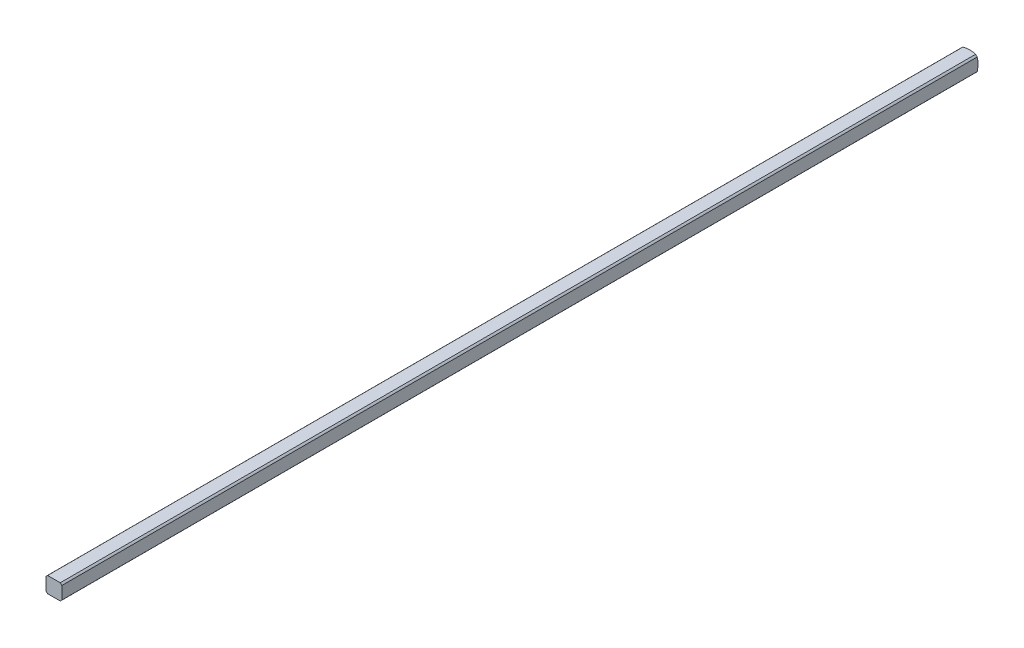
ISO-10303-21;
HEADER;
FILE_DESCRIPTION(('STEP AP214'),'2;1');
FILE_NAME('part.step','',(''),(''),'','','');
FILE_SCHEMA(('AUTOMOTIVE_DESIGN { 1 0 10303 214 1 1 1 1 }'));
ENDSEC;
DATA;
#1=APPLICATION_CONTEXT('core data for automotive mechanical design processes');
#2=APPLICATION_PROTOCOL_DEFINITION('international standard','automotive_design',2000,#1);
#3=PRODUCT_CONTEXT('',#1,'mechanical');
#4=PRODUCT('Part','Part','',(#3));
#5=PRODUCT_RELATED_PRODUCT_CATEGORY('part','',(#4));
#6=PRODUCT_DEFINITION_FORMATION('','',#4);
#7=PRODUCT_DEFINITION_CONTEXT('part definition',#1,'design');
#8=PRODUCT_DEFINITION('design','',#6,#7);
#9=PRODUCT_DEFINITION_SHAPE('','',#8);
#10=(LENGTH_UNIT() NAMED_UNIT(*) SI_UNIT(.MILLI.,.METRE.));
#11=(NAMED_UNIT(*) PLANE_ANGLE_UNIT() SI_UNIT($,.RADIAN.));
#12=(NAMED_UNIT(*) SI_UNIT($,.STERADIAN.) SOLID_ANGLE_UNIT());
#13=UNCERTAINTY_MEASURE_WITH_UNIT(LENGTH_MEASURE(1.E-05),#10,'distance_accuracy_value','');
#14=(GEOMETRIC_REPRESENTATION_CONTEXT(3) GLOBAL_UNCERTAINTY_ASSIGNED_CONTEXT((#13)) GLOBAL_UNIT_ASSIGNED_CONTEXT((#10,
#11,#12)) REPRESENTATION_CONTEXT('',''));
#15=CARTESIAN_POINT('',(0.,0.,0.));
#16=DIRECTION('',(0.,0.,1.));
#17=DIRECTION('',(1.,0.,0.));
#18=AXIS2_PLACEMENT_3D('',#15,#16,#17);
#19=CARTESIAN_POINT('',(-1.5875,-1.5875,152.4));
#20=DIRECTION('',(1.,0.,0.));
#21=DIRECTION('',(0.,0.,-1.));
#22=AXIS2_PLACEMENT_3D('',#19,#20,#21);
#23=PLANE('',#22);
#24=DIRECTION('',(0.,0.,-1.));
#25=VECTOR('',#24,1.);
#26=CARTESIAN_POINT('',(-1.5875,-1.26841150657032,152.4));
#27=LINE('',#26,#25);
#28=CARTESIAN_POINT('',(-1.5875,-1.26841150657032,183.886774642313));
#29=VERTEX_POINT('',#28);
#30=CARTESIAN_POINT('',(-1.5875,-1.26841150657032,0.263225357686905));
#31=VERTEX_POINT('',#30);
#32=EDGE_CURVE('E105',#29,#31,#27,.T.);
#33=ORIENTED_EDGE('',*,*,#32,.F.);
#34=DIRECTION('',(0.,1.,0.));
#35=VECTOR('',#34,1.);
#36=CARTESIAN_POINT('',(-1.5875,-1.58749999999999,183.886774642313));
#37=LINE('',#36,#35);
#38=CARTESIAN_POINT('',(-1.5875,1.26841150657032,183.886774642313));
#39=VERTEX_POINT('',#38);
#40=EDGE_CURVE('E36',#29,#39,#37,.T.);
#41=ORIENTED_EDGE('',*,*,#40,.T.);
#42=DIRECTION('',(0.,0.,-1.));
#43=VECTOR('',#42,1.);
#44=CARTESIAN_POINT('',(-1.5875,1.26841150657032,152.4));
#45=LINE('',#44,#43);
#46=CARTESIAN_POINT('',(-1.5875,1.26841150657032,0.263225357687025));
#47=VERTEX_POINT('',#46);
#48=EDGE_CURVE('E114',#47,#39,#45,.F.);
#49=ORIENTED_EDGE('',*,*,#48,.F.);
#50=CARTESIAN_POINT('',(-1.5875,0.,4.91912226376204));
#51=DIRECTION('',(1.,0.,0.));
#52=DIRECTION('',(0.,0.,-1.));
#53=AXIS2_PLACEMENT_3D('',#50,#51,#52);
#54=CIRCLE('',#53,4.82558221875869);
#55=EDGE_CURVE('E139',#31,#47,#54,.T.);
#56=ORIENTED_EDGE('',*,*,#55,.F.);
#57=EDGE_LOOP('',(#33,#41,#49,#56));
#58=FACE_BOUND('',#57,.T.);
#59=ADVANCED_FACE('F33',(#58),#23,.F.);
#60=CARTESIAN_POINT('',(-1.5875,-1.5875,152.4));
#61=DIRECTION('',(0.,1.,0.));
#62=DIRECTION('',(0.,0.,1.));
#63=AXIS2_PLACEMENT_3D('',#60,#61,#62);
#64=PLANE('',#63);
#65=DIRECTION('',(0.,0.,-1.));
#66=VECTOR('',#65,1.);
#67=CARTESIAN_POINT('',(1.26841150657032,-1.5875,152.4));
#68=LINE('',#67,#66);
#69=CARTESIAN_POINT('',(1.26841150657033,-1.58749999999999,183.886774642313));
#70=VERTEX_POINT('',#69);
#71=CARTESIAN_POINT('',(1.26841150657032,-1.5875,0.263225357686905));
#72=VERTEX_POINT('',#71);
#73=EDGE_CURVE('E136',#70,#72,#68,.T.);
#74=ORIENTED_EDGE('',*,*,#73,.F.);
#75=DIRECTION('',(1.,0.,0.));
#76=VECTOR('',#75,1.);
#77=CARTESIAN_POINT('',(-1.5875,-1.58749999999999,183.886774642313));
#78=LINE('',#77,#76);
#79=CARTESIAN_POINT('',(-1.26841150657033,-1.58749999999999,183.886774642313));
#80=VERTEX_POINT('',#79);
#81=EDGE_CURVE('E69',#80,#70,#78,.T.);
#82=ORIENTED_EDGE('',*,*,#81,.F.);
#83=DIRECTION('',(0.,0.,-1.));
#84=VECTOR('',#83,1.);
#85=CARTESIAN_POINT('',(-1.26841150657032,-1.5875,152.4));
#86=LINE('',#85,#84);
#87=CARTESIAN_POINT('',(-1.26841150657032,-1.5875,0.263225357686961));
#88=VERTEX_POINT('',#87);
#89=EDGE_CURVE('E144',#88,#80,#86,.F.);
#90=ORIENTED_EDGE('',*,*,#89,.F.);
#91=CARTESIAN_POINT('',(0.,-1.5875,4.91912226376204));
#92=DIRECTION('',(0.,1.,0.));
#93=DIRECTION('',(0.,0.,1.));
#94=AXIS2_PLACEMENT_3D('',#91,#92,#93);
#95=CIRCLE('',#94,4.82558221875869);
#96=EDGE_CURVE('E137',#72,#88,#95,.T.);
#97=ORIENTED_EDGE('',*,*,#96,.F.);
#98=EDGE_LOOP('',(#74,#82,#90,#97));
#99=FACE_BOUND('',#98,.T.);
#100=ADVANCED_FACE('F159',(#99),#64,.F.);
#101=CARTESIAN_POINT('',(1.5875,-1.5875,152.4));
#102=DIRECTION('',(-1.,0.,0.));
#103=DIRECTION('',(0.,0.,1.));
#104=AXIS2_PLACEMENT_3D('',#101,#102,#103);
#105=PLANE('',#104);
#106=DIRECTION('',(0.,0.,-1.));
#107=VECTOR('',#106,1.);
#108=CARTESIAN_POINT('',(1.5875,1.26841150657032,152.4));
#109=LINE('',#108,#107);
#110=CARTESIAN_POINT('',(1.5875,1.26841150657032,183.886774642313));
#111=VERTEX_POINT('',#110);
#112=CARTESIAN_POINT('',(1.5875,1.26841150657032,0.263225357686961));
#113=VERTEX_POINT('',#112);
#114=EDGE_CURVE('E147',#111,#113,#109,.T.);
#115=ORIENTED_EDGE('',*,*,#114,.F.);
#116=DIRECTION('',(0.,1.,0.));
#117=VECTOR('',#116,1.);
#118=CARTESIAN_POINT('',(1.5875,-1.58749999999999,183.886774642313));
#119=LINE('',#118,#117);
#120=CARTESIAN_POINT('',(1.5875,-1.26841150657032,183.886774642313));
#121=VERTEX_POINT('',#120);
#122=EDGE_CURVE('E60',#121,#111,#119,.T.);
#123=ORIENTED_EDGE('',*,*,#122,.F.);
#124=DIRECTION('',(0.,0.,-1.));
#125=VECTOR('',#124,1.);
#126=CARTESIAN_POINT('',(1.5875,-1.26841150657032,152.4));
#127=LINE('',#126,#125);
#128=CARTESIAN_POINT('',(1.5875,-1.26841150657032,0.263225357686905));
#129=VERTEX_POINT('',#128);
#130=EDGE_CURVE('E125',#129,#121,#127,.F.);
#131=ORIENTED_EDGE('',*,*,#130,.F.);
#132=CARTESIAN_POINT('',(1.5875,0.,4.91912226376204));
#133=DIRECTION('',(-1.,0.,0.));
#134=DIRECTION('',(0.,0.,1.));
#135=AXIS2_PLACEMENT_3D('',#132,#133,#134);
#136=CIRCLE('',#135,4.82558221875869);
#137=EDGE_CURVE('E132',#113,#129,#136,.T.);
#138=ORIENTED_EDGE('',*,*,#137,.F.);
#139=EDGE_LOOP('',(#115,#123,#131,#138));
#140=FACE_BOUND('',#139,.T.);
#141=ADVANCED_FACE('F176',(#140),#105,.F.);
#142=CARTESIAN_POINT('',(-1.5875,1.5875,152.4));
#143=DIRECTION('',(0.,-1.,0.));
#144=DIRECTION('',(0.,0.,-1.));
#145=AXIS2_PLACEMENT_3D('',#142,#143,#144);
#146=PLANE('',#145);
#147=DIRECTION('',(0.,0.,-1.));
#148=VECTOR('',#147,1.);
#149=CARTESIAN_POINT('',(-1.26841150657032,1.5875,152.4));
#150=LINE('',#149,#148);
#151=CARTESIAN_POINT('',(-1.26841150657032,1.5875,183.886774642313));
#152=VERTEX_POINT('',#151);
#153=CARTESIAN_POINT('',(-1.26841150657032,1.5875,0.263225357686961));
#154=VERTEX_POINT('',#153);
#155=EDGE_CURVE('E111',#152,#154,#150,.T.);
#156=ORIENTED_EDGE('',*,*,#155,.F.);
#157=DIRECTION('',(1.,0.,0.));
#158=VECTOR('',#157,1.);
#159=CARTESIAN_POINT('',(-1.5875,1.58750000000001,183.886774642313));
#160=LINE('',#159,#158);
#161=CARTESIAN_POINT('',(1.26841150657032,1.58750000000001,183.886774642313));
#162=VERTEX_POINT('',#161);
#163=EDGE_CURVE('E98',#152,#162,#160,.T.);
#164=ORIENTED_EDGE('',*,*,#163,.T.);
#165=DIRECTION('',(0.,0.,-1.));
#166=VECTOR('',#165,1.);
#167=CARTESIAN_POINT('',(1.26841150657032,1.5875,152.4));
#168=LINE('',#167,#166);
#169=CARTESIAN_POINT('',(1.26841150657032,1.5875,0.263225357686905));
#170=VERTEX_POINT('',#169);
#171=EDGE_CURVE('E119',#170,#162,#168,.F.);
#172=ORIENTED_EDGE('',*,*,#171,.F.);
#173=CARTESIAN_POINT('',(0.,1.5875,4.91912226376204));
#174=DIRECTION('',(0.,-1.,0.));
#175=DIRECTION('',(0.,0.,-1.));
#176=AXIS2_PLACEMENT_3D('',#173,#174,#175);
#177=CIRCLE('',#176,4.82558221875869);
#178=EDGE_CURVE('E117',#154,#170,#177,.T.);
#179=ORIENTED_EDGE('',*,*,#178,.F.);
#180=EDGE_LOOP('',(#156,#164,#172,#179));
#181=FACE_BOUND('',#180,.T.);
#182=ADVANCED_FACE('F116',(#181),#146,.F.);
#183=CARTESIAN_POINT('',(0.,0.,152.4));
#184=DIRECTION('',(0.,0.,-1.));
#185=DIRECTION('',(-1.,0.,0.));
#186=AXIS2_PLACEMENT_3D('',#183,#184,#185);
#187=CYLINDRICAL_SURFACE('',#186,2.032);
#188=CARTESIAN_POINT('',(0.,0.,183.886774642313));
#189=DIRECTION('',(0.,0.,-1.));
#190=DIRECTION('',(-1.,0.,0.));
#191=AXIS2_PLACEMENT_3D('',#188,#189,#190);
#192=CIRCLE('',#191,2.032);
#193=EDGE_CURVE('E131',#29,#80,#192,.F.);
#194=ORIENTED_EDGE('',*,*,#193,.F.);
#195=ORIENTED_EDGE('',*,*,#32,.T.);
#196=CARTESIAN_POINT('',(0.,0.,0.263225357686961));
#197=DIRECTION('',(0.,0.,1.));
#198=DIRECTION('',(1.,0.,0.));
#199=AXIS2_PLACEMENT_3D('',#196,#197,#198);
#200=CIRCLE('',#199,2.032);
#201=EDGE_CURVE('E141',#31,#88,#200,.T.);
#202=ORIENTED_EDGE('',*,*,#201,.T.);
#203=ORIENTED_EDGE('',*,*,#89,.T.);
#204=EDGE_LOOP('',(#194,#195,#202,#203));
#205=FACE_BOUND('',#204,.T.);
#206=ADVANCED_FACE('F161',(#205),#187,.T.);
#207=CARTESIAN_POINT('',(0.,0.,183.886774642313));
#208=DIRECTION('',(0.,0.,-1.));
#209=DIRECTION('',(-1.,0.,0.));
#210=AXIS2_PLACEMENT_3D('',#207,#208,#209);
#211=CIRCLE('',#210,2.032);
#212=EDGE_CURVE('E65',#70,#121,#211,.F.);
#213=ORIENTED_EDGE('',*,*,#212,.F.);
#214=ORIENTED_EDGE('',*,*,#73,.T.);
#215=CARTESIAN_POINT('',(0.,0.,0.263225357686961));
#216=DIRECTION('',(0.,0.,1.));
#217=DIRECTION('',(1.,0.,0.));
#218=AXIS2_PLACEMENT_3D('',#215,#216,#217);
#219=CIRCLE('',#218,2.032);
#220=EDGE_CURVE('E133',#72,#129,#219,.T.);
#221=ORIENTED_EDGE('',*,*,#220,.T.);
#222=ORIENTED_EDGE('',*,*,#130,.T.);
#223=EDGE_LOOP('',(#213,#214,#221,#222));
#224=FACE_BOUND('',#223,.T.);
#225=ADVANCED_FACE('F172',(#224),#187,.T.);
#226=CARTESIAN_POINT('',(0.,0.,183.886774642313));
#227=DIRECTION('',(0.,0.,-1.));
#228=DIRECTION('',(-1.,0.,0.));
#229=AXIS2_PLACEMENT_3D('',#226,#227,#228);
#230=CIRCLE('',#229,2.032);
#231=EDGE_CURVE('E42',#111,#162,#230,.F.);
#232=ORIENTED_EDGE('',*,*,#231,.F.);
#233=ORIENTED_EDGE('',*,*,#114,.T.);
#234=CARTESIAN_POINT('',(0.,0.,0.263225357686961));
#235=DIRECTION('',(0.,0.,1.));
#236=DIRECTION('',(1.,0.,0.));
#237=AXIS2_PLACEMENT_3D('',#234,#235,#236);
#238=CIRCLE('',#237,2.032);
#239=EDGE_CURVE('E122',#113,#170,#238,.T.);
#240=ORIENTED_EDGE('',*,*,#239,.T.);
#241=ORIENTED_EDGE('',*,*,#171,.T.);
#242=EDGE_LOOP('',(#232,#233,#240,#241));
#243=FACE_BOUND('',#242,.T.);
#244=ADVANCED_FACE('F179',(#243),#187,.T.);
#245=CARTESIAN_POINT('',(0.,0.,183.886774642313));
#246=DIRECTION('',(0.,0.,-1.));
#247=DIRECTION('',(-1.,0.,0.));
#248=AXIS2_PLACEMENT_3D('',#245,#246,#247);
#249=CIRCLE('',#248,2.032);
#250=EDGE_CURVE('E12',#152,#39,#249,.F.);
#251=ORIENTED_EDGE('',*,*,#250,.F.);
#252=ORIENTED_EDGE('',*,*,#155,.T.);
#253=CARTESIAN_POINT('',(0.,0.,0.263225357686961));
#254=DIRECTION('',(0.,0.,1.));
#255=DIRECTION('',(1.,0.,0.));
#256=AXIS2_PLACEMENT_3D('',#253,#254,#255);
#257=CIRCLE('',#256,2.032);
#258=EDGE_CURVE('E118',#154,#47,#257,.T.);
#259=ORIENTED_EDGE('',*,*,#258,.T.);
#260=ORIENTED_EDGE('',*,*,#48,.T.);
#261=EDGE_LOOP('',(#251,#252,#259,#260));
#262=FACE_BOUND('',#261,.T.);
#263=ADVANCED_FACE('F109',(#262),#187,.T.);
#264=CARTESIAN_POINT('',(0.,0.,4.91912226376204));
#265=DIRECTION('',(0.,0.,1.));
#266=DIRECTION('',(-1.,0.,0.));
#267=AXIS2_PLACEMENT_3D('',#264,#265,#266);
#268=SPHERICAL_SURFACE('',#267,5.08);
#269=CARTESIAN_POINT('',(0.,0.,0.));
#270=DIRECTION('',(0.,0.,-1.));
#271=DIRECTION('',(-1.,0.,0.));
#272=AXIS2_PLACEMENT_3D('',#269,#270,#271);
#273=CIRCLE('',#272,1.26832020963187);
#274=CARTESIAN_POINT('',(-1.26832020963187,0.,0.));
#275=VERTEX_POINT('',#274);
#276=EDGE_CURVE('E128',#275,#275,#273,.T.);
#277=ORIENTED_EDGE('',*,*,#276,.F.);
#278=EDGE_LOOP('',(#277));
#279=FACE_BOUND('',#278,.T.);
#280=ORIENTED_EDGE('',*,*,#96,.T.);
#281=ORIENTED_EDGE('',*,*,#201,.F.);
#282=ORIENTED_EDGE('',*,*,#55,.T.);
#283=ORIENTED_EDGE('',*,*,#258,.F.);
#284=ORIENTED_EDGE('',*,*,#178,.T.);
#285=ORIENTED_EDGE('',*,*,#239,.F.);
#286=ORIENTED_EDGE('',*,*,#137,.T.);
#287=ORIENTED_EDGE('',*,*,#220,.F.);
#288=EDGE_LOOP('',(#280,#281,#282,#283,#284,#285,#286,#287));
#289=FACE_BOUND('',#288,.T.);
#290=ADVANCED_FACE('F178',(#279,#289),#268,.T.);
#291=CARTESIAN_POINT('',(0.,0.,0.));
#292=DIRECTION('',(0.,0.,-1.));
#293=DIRECTION('',(-1.,0.,0.));
#294=AXIS2_PLACEMENT_3D('',#291,#292,#293);
#295=PLANE('',#294);
#296=ORIENTED_EDGE('',*,*,#276,.T.);
#297=EDGE_LOOP('',(#296));
#298=FACE_BOUND('',#297,.T.);
#299=ADVANCED_FACE('F203',(#298),#295,.T.);
#300=CARTESIAN_POINT('',(-1.5875,-1.58749999999999,183.886774642313));
#301=DIRECTION('',(0.,0.,-1.));
#302=DIRECTION('',(-1.,0.,0.));
#303=AXIS2_PLACEMENT_3D('',#300,#301,#302);
#304=PLANE('',#303);
#305=ORIENTED_EDGE('',*,*,#193,.T.);
#306=ORIENTED_EDGE('',*,*,#81,.T.);
#307=ORIENTED_EDGE('',*,*,#212,.T.);
#308=ORIENTED_EDGE('',*,*,#122,.T.);
#309=ORIENTED_EDGE('',*,*,#231,.T.);
#310=ORIENTED_EDGE('',*,*,#163,.F.);
#311=ORIENTED_EDGE('',*,*,#250,.T.);
#312=ORIENTED_EDGE('',*,*,#40,.F.);
#313=EDGE_LOOP('',(#305,#306,#307,#308,#309,#310,#311,#312));
#314=FACE_BOUND('',#313,.T.);
#315=ADVANCED_FACE('F100',(#314),#304,.F.);
#316=CLOSED_SHELL('',(#59,#100,#141,#182,#206,#225,#244,#263,#290,#299,#315));
#317=MANIFOLD_SOLID_BREP('B2',#316);
#318=ADVANCED_BREP_SHAPE_REPRESENTATION('',(#18,#317),#14);
#319=SHAPE_DEFINITION_REPRESENTATION(#9,#318);
ENDSEC;
END-ISO-10303-21;
